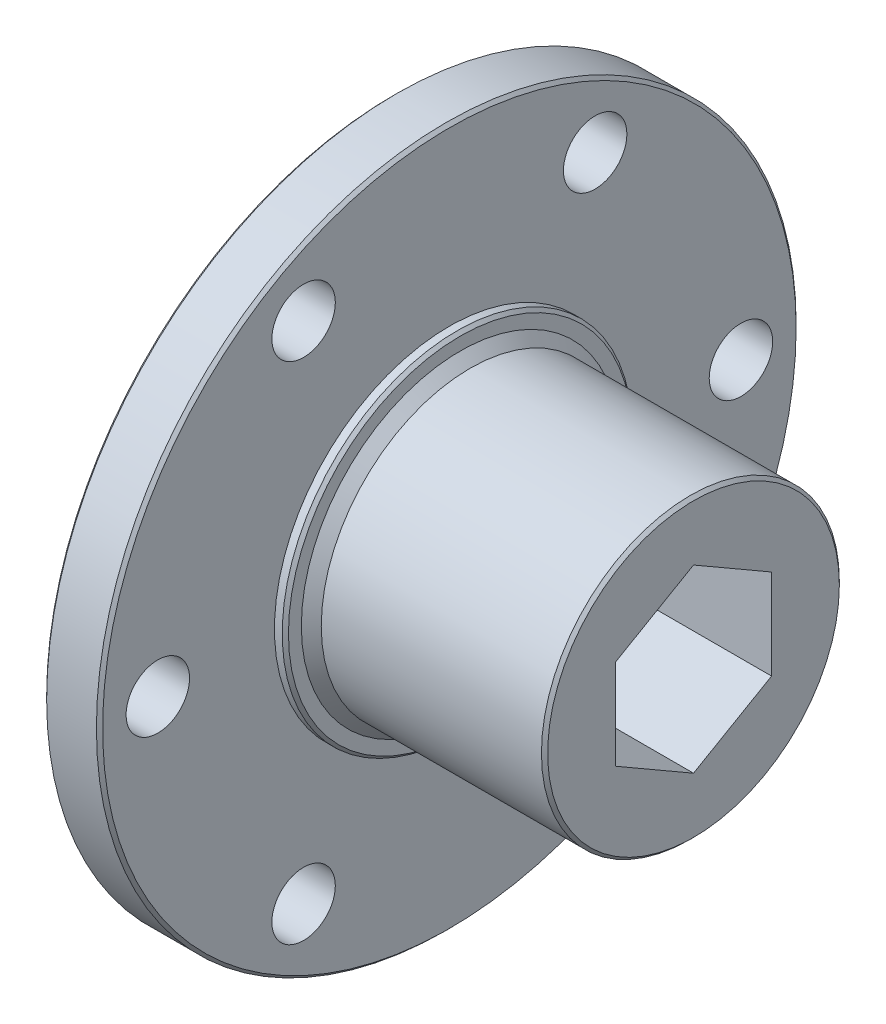
ISO-10303-21;
HEADER;
FILE_DESCRIPTION(('STEP AP214'),'2;1');
FILE_NAME('part.step','',(''),(''),'','','');
FILE_SCHEMA(('AUTOMOTIVE_DESIGN { 1 0 10303 214 1 1 1 1 }'));
ENDSEC;
DATA;
#1=APPLICATION_CONTEXT('core data for automotive mechanical design processes');
#2=APPLICATION_PROTOCOL_DEFINITION('international standard','automotive_design',2000,#1);
#3=PRODUCT_CONTEXT('',#1,'mechanical');
#4=PRODUCT('Part','Part','',(#3));
#5=PRODUCT_RELATED_PRODUCT_CATEGORY('part','',(#4));
#6=PRODUCT_DEFINITION_FORMATION('','',#4);
#7=PRODUCT_DEFINITION_CONTEXT('part definition',#1,'design');
#8=PRODUCT_DEFINITION('design','',#6,#7);
#9=PRODUCT_DEFINITION_SHAPE('','',#8);
#10=(LENGTH_UNIT() NAMED_UNIT(*) SI_UNIT(.MILLI.,.METRE.));
#11=(NAMED_UNIT(*) PLANE_ANGLE_UNIT() SI_UNIT($,.RADIAN.));
#12=(NAMED_UNIT(*) SI_UNIT($,.STERADIAN.) SOLID_ANGLE_UNIT());
#13=UNCERTAINTY_MEASURE_WITH_UNIT(LENGTH_MEASURE(1.E-05),#10,'distance_accuracy_value','');
#14=(GEOMETRIC_REPRESENTATION_CONTEXT(3) GLOBAL_UNCERTAINTY_ASSIGNED_CONTEXT((#13)) GLOBAL_UNIT_ASSIGNED_CONTEXT((#10,
#11,#12)) REPRESENTATION_CONTEXT('',''));
#15=CARTESIAN_POINT('',(0.,0.,0.));
#16=DIRECTION('',(0.,0.,1.));
#17=DIRECTION('',(1.,0.,0.));
#18=AXIS2_PLACEMENT_3D('',#15,#16,#17);
#19=CARTESIAN_POINT('',(-13.9240662460568,0.,0.));
#20=DIRECTION('',(-1.,0.,0.));
#21=DIRECTION('',(0.,0.,1.));
#22=AXIS2_PLACEMENT_3D('',#19,#20,#21);
#23=CYLINDRICAL_SURFACE('',#22,28.575);
#24=CARTESIAN_POINT('',(-18.2420662460566,0.,0.));
#25=DIRECTION('',(-1.,0.,0.));
#26=DIRECTION('',(0.,0.,1.));
#27=AXIS2_PLACEMENT_3D('',#24,#25,#26);
#28=CIRCLE('',#27,28.575);
#29=CARTESIAN_POINT('',(-18.2420662460566,0.,28.575));
#30=VERTEX_POINT('',#29);
#31=EDGE_CURVE('E179',#30,#30,#28,.F.);
#32=ORIENTED_EDGE('',*,*,#31,.T.);
#33=EDGE_LOOP('',(#32));
#34=FACE_BOUND('',#33,.T.);
#35=CARTESIAN_POINT('',(-14.1780662460569,0.,0.));
#36=DIRECTION('',(1.,0.,0.));
#37=DIRECTION('',(0.,0.,-1.));
#38=AXIS2_PLACEMENT_3D('',#35,#36,#37);
#39=CIRCLE('',#38,28.575);
#40=CARTESIAN_POINT('',(-14.1780662460569,0.,-28.575));
#41=VERTEX_POINT('',#40);
#42=EDGE_CURVE('E176',#41,#41,#39,.F.);
#43=ORIENTED_EDGE('',*,*,#42,.T.);
#44=EDGE_LOOP('',(#43));
#45=FACE_BOUND('',#44,.T.);
#46=ADVANCED_FACE('F37',(#34,#45),#23,.T.);
#47=CARTESIAN_POINT('',(-13.9240662460568,28.575,0.));
#48=DIRECTION('',(1.,0.,0.));
#49=DIRECTION('',(0.,0.,-1.));
#50=AXIS2_PLACEMENT_3D('',#47,#48,#49);
#51=PLANE('',#50);
#52=CARTESIAN_POINT('',(-13.9240662460568,0.,0.));
#53=DIRECTION('',(1.,0.,0.));
#54=DIRECTION('',(0.,0.,-1.));
#55=AXIS2_PLACEMENT_3D('',#52,#53,#54);
#56=CIRCLE('',#55,28.3209999999999);
#57=CARTESIAN_POINT('',(-13.9240662460568,0.,-28.3209999999999));
#58=VERTEX_POINT('',#57);
#59=EDGE_CURVE('E11',#58,#58,#56,.T.);
#60=ORIENTED_EDGE('',*,*,#59,.T.);
#61=EDGE_LOOP('',(#60));
#62=FACE_BOUND('',#61,.T.);
#63=CARTESIAN_POINT('',(-13.9240662460568,20.6222299276169,11.90625));
#64=DIRECTION('',(1.,0.,0.));
#65=DIRECTION('',(0.,0.,-1.));
#66=AXIS2_PLACEMENT_3D('',#63,#64,#65);
#67=CIRCLE('',#66,2.5908);
#68=CARTESIAN_POINT('',(-13.9240662460568,20.6222299276169,9.31545000000001));
#69=VERTEX_POINT('',#68);
#70=EDGE_CURVE('E157',#69,#69,#67,.T.);
#71=ORIENTED_EDGE('',*,*,#70,.F.);
#72=EDGE_LOOP('',(#71));
#73=FACE_BOUND('',#72,.T.);
#74=CARTESIAN_POINT('',(-13.9240662460568,0.,-23.8125));
#75=DIRECTION('',(1.,0.,0.));
#76=DIRECTION('',(0.,0.,-1.));
#77=AXIS2_PLACEMENT_3D('',#74,#75,#76);
#78=CIRCLE('',#77,2.5908);
#79=CARTESIAN_POINT('',(-13.9240662460568,0.,-26.4033));
#80=VERTEX_POINT('',#79);
#81=EDGE_CURVE('E331',#80,#80,#78,.T.);
#82=ORIENTED_EDGE('',*,*,#81,.F.);
#83=EDGE_LOOP('',(#82));
#84=FACE_BOUND('',#83,.T.);
#85=CARTESIAN_POINT('',(-13.9240662460568,-20.622229927617,11.9062499999999));
#86=DIRECTION('',(1.,0.,0.));
#87=DIRECTION('',(0.,0.,-1.));
#88=AXIS2_PLACEMENT_3D('',#85,#86,#87);
#89=CIRCLE('',#88,2.5908);
#90=CARTESIAN_POINT('',(-13.9240662460568,-20.622229927617,9.31544999999995));
#91=VERTEX_POINT('',#90);
#92=EDGE_CURVE('E335',#91,#91,#89,.T.);
#93=ORIENTED_EDGE('',*,*,#92,.F.);
#94=EDGE_LOOP('',(#93));
#95=FACE_BOUND('',#94,.T.);
#96=CARTESIAN_POINT('',(-13.9240662460568,-20.6222299276169,-11.90625));
#97=DIRECTION('',(1.,0.,0.));
#98=DIRECTION('',(0.,0.,-1.));
#99=AXIS2_PLACEMENT_3D('',#96,#97,#98);
#100=CIRCLE('',#99,2.5908);
#101=CARTESIAN_POINT('',(-13.9240662460568,-20.6222299276169,-14.49705));
#102=VERTEX_POINT('',#101);
#103=EDGE_CURVE('E339',#102,#102,#100,.T.);
#104=ORIENTED_EDGE('',*,*,#103,.F.);
#105=EDGE_LOOP('',(#104));
#106=FACE_BOUND('',#105,.T.);
#107=CARTESIAN_POINT('',(-13.9240662460568,20.622229927617,-11.90625));
#108=DIRECTION('',(1.,0.,0.));
#109=DIRECTION('',(0.,0.,-1.));
#110=AXIS2_PLACEMENT_3D('',#107,#108,#109);
#111=CIRCLE('',#110,2.5908);
#112=CARTESIAN_POINT('',(-13.9240662460568,20.622229927617,-14.49705));
#113=VERTEX_POINT('',#112);
#114=EDGE_CURVE('E343',#113,#113,#111,.T.);
#115=ORIENTED_EDGE('',*,*,#114,.F.);
#116=EDGE_LOOP('',(#115));
#117=FACE_BOUND('',#116,.T.);
#118=CARTESIAN_POINT('',(-13.9240662460568,0.,23.8125));
#119=DIRECTION('',(1.,0.,0.));
#120=DIRECTION('',(0.,0.,-1.));
#121=AXIS2_PLACEMENT_3D('',#118,#119,#120);
#122=CIRCLE('',#121,2.5908);
#123=CARTESIAN_POINT('',(-13.9240662460568,0.,21.2217));
#124=VERTEX_POINT('',#123);
#125=EDGE_CURVE('E114',#124,#124,#122,.T.);
#126=ORIENTED_EDGE('',*,*,#125,.F.);
#127=EDGE_LOOP('',(#126));
#128=FACE_BOUND('',#127,.T.);
#129=CARTESIAN_POINT('',(-13.9240662460568,0.,0.));
#130=DIRECTION('',(1.,0.,0.));
#131=DIRECTION('',(0.,0.,-1.));
#132=AXIS2_PLACEMENT_3D('',#129,#130,#131);
#133=CIRCLE('',#132,14.2875);
#134=CARTESIAN_POINT('',(-13.9240662460568,0.,-14.2875));
#135=VERTEX_POINT('',#134);
#136=EDGE_CURVE('E152',#135,#135,#133,.T.);
#137=ORIENTED_EDGE('',*,*,#136,.F.);
#138=EDGE_LOOP('',(#137));
#139=FACE_BOUND('',#138,.T.);
#140=ADVANCED_FACE('F214',(#62,#73,#84,#95,#106,#117,#128,#139),#51,.T.);
#141=CARTESIAN_POINT('',(-18.4960662460568,0.,0.));
#142=DIRECTION('',(-1.,0.,0.));
#143=DIRECTION('',(0.,0.,1.));
#144=AXIS2_PLACEMENT_3D('',#141,#142,#143);
#145=PLANE('',#144);
#146=CARTESIAN_POINT('',(-18.4960662460568,0.,0.));
#147=DIRECTION('',(-1.,0.,0.));
#148=DIRECTION('',(0.,0.,1.));
#149=AXIS2_PLACEMENT_3D('',#146,#147,#148);
#150=CIRCLE('',#149,28.3209999999999);
#151=CARTESIAN_POINT('',(-18.4960662460568,0.,28.3209999999999));
#152=VERTEX_POINT('',#151);
#153=EDGE_CURVE('E173',#152,#152,#150,.T.);
#154=ORIENTED_EDGE('',*,*,#153,.T.);
#155=EDGE_LOOP('',(#154));
#156=FACE_BOUND('',#155,.T.);
#157=CARTESIAN_POINT('',(-18.4960662460568,20.6222299276169,11.90625));
#158=DIRECTION('',(-1.,0.,0.));
#159=DIRECTION('',(0.,0.,1.));
#160=AXIS2_PLACEMENT_3D('',#157,#158,#159);
#161=CIRCLE('',#160,2.5908);
#162=CARTESIAN_POINT('',(-18.4960662460568,20.6222299276169,14.49705));
#163=VERTEX_POINT('',#162);
#164=EDGE_CURVE('E161',#163,#163,#161,.T.);
#165=ORIENTED_EDGE('',*,*,#164,.F.);
#166=EDGE_LOOP('',(#165));
#167=FACE_BOUND('',#166,.T.);
#168=CARTESIAN_POINT('',(-18.4960662460568,0.,-23.8125));
#169=DIRECTION('',(-1.,0.,0.));
#170=DIRECTION('',(0.,0.,1.));
#171=AXIS2_PLACEMENT_3D('',#168,#169,#170);
#172=CIRCLE('',#171,2.5908);
#173=CARTESIAN_POINT('',(-18.4960662460568,0.,-21.2217));
#174=VERTEX_POINT('',#173);
#175=EDGE_CURVE('E160',#174,#174,#172,.T.);
#176=ORIENTED_EDGE('',*,*,#175,.F.);
#177=EDGE_LOOP('',(#176));
#178=FACE_BOUND('',#177,.T.);
#179=CARTESIAN_POINT('',(-18.4960662460568,-20.622229927617,11.9062499999999));
#180=DIRECTION('',(-1.,0.,0.));
#181=DIRECTION('',(0.,0.,1.));
#182=AXIS2_PLACEMENT_3D('',#179,#180,#181);
#183=CIRCLE('',#182,2.5908);
#184=CARTESIAN_POINT('',(-18.4960662460568,-20.622229927617,14.4970499999999));
#185=VERTEX_POINT('',#184);
#186=EDGE_CURVE('E254',#185,#185,#183,.T.);
#187=ORIENTED_EDGE('',*,*,#186,.F.);
#188=EDGE_LOOP('',(#187));
#189=FACE_BOUND('',#188,.T.);
#190=CARTESIAN_POINT('',(-18.4960662460568,-20.6222299276169,-11.90625));
#191=DIRECTION('',(-1.,0.,0.));
#192=DIRECTION('',(0.,0.,1.));
#193=AXIS2_PLACEMENT_3D('',#190,#191,#192);
#194=CIRCLE('',#193,2.5908);
#195=CARTESIAN_POINT('',(-18.4960662460568,-20.6222299276169,-9.31545000000004));
#196=VERTEX_POINT('',#195);
#197=EDGE_CURVE('E258',#196,#196,#194,.T.);
#198=ORIENTED_EDGE('',*,*,#197,.F.);
#199=EDGE_LOOP('',(#198));
#200=FACE_BOUND('',#199,.T.);
#201=CARTESIAN_POINT('',(-18.4960662460568,20.622229927617,-11.90625));
#202=DIRECTION('',(-1.,0.,0.));
#203=DIRECTION('',(0.,0.,1.));
#204=AXIS2_PLACEMENT_3D('',#201,#202,#203);
#205=CIRCLE('',#204,2.5908);
#206=CARTESIAN_POINT('',(-18.4960662460568,20.622229927617,-9.31544999999997));
#207=VERTEX_POINT('',#206);
#208=EDGE_CURVE('E262',#207,#207,#205,.T.);
#209=ORIENTED_EDGE('',*,*,#208,.F.);
#210=EDGE_LOOP('',(#209));
#211=FACE_BOUND('',#210,.T.);
#212=CARTESIAN_POINT('',(-18.4960662460568,0.,23.8125));
#213=DIRECTION('',(-1.,0.,0.));
#214=DIRECTION('',(0.,0.,1.));
#215=AXIS2_PLACEMENT_3D('',#212,#213,#214);
#216=CIRCLE('',#215,2.5908);
#217=CARTESIAN_POINT('',(-18.4960662460568,0.,26.4033));
#218=VERTEX_POINT('',#217);
#219=EDGE_CURVE('E266',#218,#218,#216,.T.);
#220=ORIENTED_EDGE('',*,*,#219,.F.);
#221=EDGE_LOOP('',(#220));
#222=FACE_BOUND('',#221,.T.);
#223=CARTESIAN_POINT('',(-18.4960662460568,0.,0.));
#224=DIRECTION('',(-1.,0.,0.));
#225=DIRECTION('',(0.,0.,1.));
#226=AXIS2_PLACEMENT_3D('',#223,#224,#225);
#227=CIRCLE('',#226,14.2875);
#228=CARTESIAN_POINT('',(-18.4960662460568,0.,14.2875));
#229=VERTEX_POINT('',#228);
#230=EDGE_CURVE('E145',#229,#229,#227,.T.);
#231=ORIENTED_EDGE('',*,*,#230,.F.);
#232=EDGE_LOOP('',(#231));
#233=FACE_BOUND('',#232,.T.);
#234=ADVANCED_FACE('F220',(#156,#167,#178,#189,#200,#211,#222,#233),#145,.T.);
#235=CARTESIAN_POINT('',(-13.0350662460568,0.,0.));
#236=DIRECTION('',(-1.,0.,0.));
#237=DIRECTION('',(0.,0.,1.));
#238=AXIS2_PLACEMENT_3D('',#235,#236,#237);
#239=CYLINDRICAL_SURFACE('',#238,14.2875);
#240=CARTESIAN_POINT('',(-13.2890662460569,0.,0.));
#241=DIRECTION('',(1.,0.,0.));
#242=DIRECTION('',(0.,0.,-1.));
#243=AXIS2_PLACEMENT_3D('',#240,#241,#242);
#244=CIRCLE('',#243,14.2875);
#245=CARTESIAN_POINT('',(-13.2890662460569,0.,-14.2875));
#246=VERTEX_POINT('',#245);
#247=EDGE_CURVE('E45',#246,#246,#244,.F.);
#248=ORIENTED_EDGE('',*,*,#247,.T.);
#249=EDGE_LOOP('',(#248));
#250=FACE_BOUND('',#249,.T.);
#251=ORIENTED_EDGE('',*,*,#136,.T.);
#252=EDGE_LOOP('',(#251));
#253=FACE_BOUND('',#252,.T.);
#254=ADVANCED_FACE('F187',(#250,#253),#239,.T.);
#255=CARTESIAN_POINT('',(-13.0350662460568,0.,0.));
#256=DIRECTION('',(1.,0.,0.));
#257=DIRECTION('',(0.,0.,-1.));
#258=AXIS2_PLACEMENT_3D('',#255,#256,#257);
#259=PLANE('',#258);
#260=CARTESIAN_POINT('',(-13.0350662460568,0.,0.));
#261=DIRECTION('',(1.,0.,0.));
#262=DIRECTION('',(0.,0.,-1.));
#263=AXIS2_PLACEMENT_3D('',#260,#261,#262);
#264=CIRCLE('',#263,14.0334999999999);
#265=CARTESIAN_POINT('',(-13.0350662460568,0.,-14.0334999999999));
#266=VERTEX_POINT('',#265);
#267=EDGE_CURVE('E182',#266,#266,#264,.T.);
#268=ORIENTED_EDGE('',*,*,#267,.T.);
#269=EDGE_LOOP('',(#268));
#270=FACE_BOUND('',#269,.T.);
#271=CARTESIAN_POINT('',(-13.0350662460568,0.,0.));
#272=DIRECTION('',(1.,0.,0.));
#273=DIRECTION('',(0.,0.,-1.));
#274=AXIS2_PLACEMENT_3D('',#271,#272,#273);
#275=CIRCLE('',#274,12.9794);
#276=CARTESIAN_POINT('',(-13.0350662460568,0.,-12.9794));
#277=VERTEX_POINT('',#276);
#278=EDGE_CURVE('E149',#277,#277,#275,.T.);
#279=ORIENTED_EDGE('',*,*,#278,.F.);
#280=EDGE_LOOP('',(#279));
#281=FACE_BOUND('',#280,.T.);
#282=ADVANCED_FACE('F196',(#270,#281),#259,.T.);
#283=CARTESIAN_POINT('',(-13.0350662460568,0.,0.));
#284=DIRECTION('',(-1.,0.,0.));
#285=DIRECTION('',(0.,0.,-1.));
#286=AXIS2_PLACEMENT_3D('',#283,#284,#285);
#287=CONICAL_SURFACE('',#286,12.9794,0.785398163397434);
#288=CARTESIAN_POINT('',(-12.2222662460567,0.,0.));
#289=DIRECTION('',(1.,0.,0.));
#290=DIRECTION('',(0.,0.,-1.));
#291=AXIS2_PLACEMENT_3D('',#288,#289,#290);
#292=CIRCLE('',#291,12.1666);
#293=CARTESIAN_POINT('',(-12.2222662460567,0.,-12.1666));
#294=VERTEX_POINT('',#293);
#295=EDGE_CURVE('E137',#294,#294,#292,.T.);
#296=ORIENTED_EDGE('',*,*,#295,.F.);
#297=EDGE_LOOP('',(#296));
#298=FACE_BOUND('',#297,.T.);
#299=ORIENTED_EDGE('',*,*,#278,.T.);
#300=EDGE_LOOP('',(#299));
#301=FACE_BOUND('',#300,.T.);
#302=ADVANCED_FACE('F199',(#298,#301),#287,.T.);
#303=CARTESIAN_POINT('',(6.01493375394323,0.,0.));
#304=DIRECTION('',(-1.,0.,0.));
#305=DIRECTION('',(0.,0.,1.));
#306=AXIS2_PLACEMENT_3D('',#303,#304,#305);
#307=CYLINDRICAL_SURFACE('',#306,12.1666);
#308=CARTESIAN_POINT('',(5.76093375394317,0.,0.));
#309=DIRECTION('',(1.,0.,0.));
#310=DIRECTION('',(0.,0.,-1.));
#311=AXIS2_PLACEMENT_3D('',#308,#309,#310);
#312=CIRCLE('',#311,12.1666);
#313=CARTESIAN_POINT('',(5.76093375394317,0.,-12.1666));
#314=VERTEX_POINT('',#313);
#315=EDGE_CURVE('E170',#314,#314,#312,.F.);
#316=ORIENTED_EDGE('',*,*,#315,.T.);
#317=EDGE_LOOP('',(#316));
#318=FACE_BOUND('',#317,.T.);
#319=ORIENTED_EDGE('',*,*,#295,.T.);
#320=EDGE_LOOP('',(#319));
#321=FACE_BOUND('',#320,.T.);
#322=ADVANCED_FACE('F204',(#318,#321),#307,.T.);
#323=CARTESIAN_POINT('',(6.01493375394323,0.,0.));
#324=DIRECTION('',(1.,0.,0.));
#325=DIRECTION('',(0.,0.,-1.));
#326=AXIS2_PLACEMENT_3D('',#323,#324,#325);
#327=PLANE('',#326);
#328=CARTESIAN_POINT('',(6.01493375394323,0.,0.));
#329=DIRECTION('',(1.,0.,0.));
#330=DIRECTION('',(0.,0.,-1.));
#331=AXIS2_PLACEMENT_3D('',#328,#329,#330);
#332=CIRCLE('',#331,11.9125999999999);
#333=CARTESIAN_POINT('',(6.01493375394323,0.,-11.9125999999999));
#334=VERTEX_POINT('',#333);
#335=EDGE_CURVE('E167',#334,#334,#332,.T.);
#336=ORIENTED_EDGE('',*,*,#335,.T.);
#337=EDGE_LOOP('',(#336));
#338=FACE_BOUND('',#337,.T.);
#339=DIRECTION('',(0.,0.500000000000001,-0.866025403784438));
#340=VECTOR('',#339,1.);
#341=CARTESIAN_POINT('',(6.01493375394323,3.68081890619155,6.3754));
#342=LINE('',#341,#340);
#343=CARTESIAN_POINT('',(6.01493375394323,3.68081890619155,6.3754));
#344=VERTEX_POINT('',#343);
#345=CARTESIAN_POINT('',(6.01493375394323,7.3616578123831,0.));
#346=VERTEX_POINT('',#345);
#347=EDGE_CURVE('E92',#344,#346,#342,.T.);
#348=ORIENTED_EDGE('',*,*,#347,.T.);
#349=DIRECTION('',(0.,-0.500000000000001,-0.866025403784438));
#350=VECTOR('',#349,1.);
#351=CARTESIAN_POINT('',(6.01493375394323,7.3616578123831,0.));
#352=LINE('',#351,#350);
#353=CARTESIAN_POINT('',(6.01493375394323,3.68081890619154,-6.37539999999999));
#354=VERTEX_POINT('',#353);
#355=EDGE_CURVE('E101',#346,#354,#352,.T.);
#356=ORIENTED_EDGE('',*,*,#355,.T.);
#357=DIRECTION('',(0.,-1.,0.));
#358=VECTOR('',#357,1.);
#359=CARTESIAN_POINT('',(6.01493375394323,3.68081890619155,-6.37539999999999));
#360=LINE('',#359,#358);
#361=CARTESIAN_POINT('',(6.01493375394323,-3.68085890619153,-6.37539999999999));
#362=VERTEX_POINT('',#361);
#363=EDGE_CURVE('E52',#354,#362,#360,.T.);
#364=ORIENTED_EDGE('',*,*,#363,.T.);
#365=DIRECTION('',(0.,-0.500000000000001,0.866025403784438));
#366=VECTOR('',#365,1.);
#367=CARTESIAN_POINT('',(6.01493375394323,-3.68085890619153,-6.37539999999999));
#368=LINE('',#367,#366);
#369=CARTESIAN_POINT('',(6.01493375394323,-7.36169781238308,0.));
#370=VERTEX_POINT('',#369);
#371=EDGE_CURVE('E118',#362,#370,#368,.T.);
#372=ORIENTED_EDGE('',*,*,#371,.T.);
#373=DIRECTION('',(0.,0.500000000000001,0.866025403784438));
#374=VECTOR('',#373,1.);
#375=CARTESIAN_POINT('',(6.01493375394323,-7.36169781238308,0.));
#376=LINE('',#375,#374);
#377=CARTESIAN_POINT('',(6.01493375394323,-3.68085890619153,6.3754));
#378=VERTEX_POINT('',#377);
#379=EDGE_CURVE('E121',#370,#378,#376,.T.);
#380=ORIENTED_EDGE('',*,*,#379,.T.);
#381=DIRECTION('',(0.,1.,0.));
#382=VECTOR('',#381,1.);
#383=CARTESIAN_POINT('',(6.01493375394323,-3.68085890619153,6.3754));
#384=LINE('',#383,#382);
#385=EDGE_CURVE('E98',#378,#344,#384,.T.);
#386=ORIENTED_EDGE('',*,*,#385,.T.);
#387=EDGE_LOOP('',(#348,#356,#364,#372,#380,#386));
#388=FACE_BOUND('',#387,.T.);
#389=ADVANCED_FACE('F105',(#338,#388),#327,.T.);
#390=CARTESIAN_POINT('',(-19.3850662460568,0.,0.));
#391=DIRECTION('',(1.,0.,0.));
#392=DIRECTION('',(0.,0.,-1.));
#393=AXIS2_PLACEMENT_3D('',#390,#391,#392);
#394=CYLINDRICAL_SURFACE('',#393,14.2875);
#395=CARTESIAN_POINT('',(-19.1310662460567,0.,0.));
#396=DIRECTION('',(-1.,0.,0.));
#397=DIRECTION('',(0.,0.,1.));
#398=AXIS2_PLACEMENT_3D('',#395,#396,#397);
#399=CIRCLE('',#398,14.2875);
#400=CARTESIAN_POINT('',(-19.1310662460567,0.,14.2875));
#401=VERTEX_POINT('',#400);
#402=EDGE_CURVE('E164',#401,#401,#399,.F.);
#403=ORIENTED_EDGE('',*,*,#402,.T.);
#404=EDGE_LOOP('',(#403));
#405=FACE_BOUND('',#404,.T.);
#406=ORIENTED_EDGE('',*,*,#230,.T.);
#407=EDGE_LOOP('',(#406));
#408=FACE_BOUND('',#407,.T.);
#409=ADVANCED_FACE('F269',(#405,#408),#394,.T.);
#410=CARTESIAN_POINT('',(-19.3850662460568,0.,0.));
#411=DIRECTION('',(-1.,0.,0.));
#412=DIRECTION('',(0.,0.,1.));
#413=AXIS2_PLACEMENT_3D('',#410,#411,#412);
#414=PLANE('',#413);
#415=CARTESIAN_POINT('',(-19.3850662460568,0.,0.));
#416=DIRECTION('',(-1.,0.,0.));
#417=DIRECTION('',(0.,0.,1.));
#418=AXIS2_PLACEMENT_3D('',#415,#416,#417);
#419=CIRCLE('',#418,14.0334999999999);
#420=CARTESIAN_POINT('',(-19.3850662460568,0.,14.0334999999999));
#421=VERTEX_POINT('',#420);
#422=EDGE_CURVE('E148',#421,#421,#419,.T.);
#423=ORIENTED_EDGE('',*,*,#422,.T.);
#424=EDGE_LOOP('',(#423));
#425=FACE_BOUND('',#424,.T.);
#426=DIRECTION('',(0.,0.500000000000001,-0.866025403784438));
#427=VECTOR('',#426,1.);
#428=CARTESIAN_POINT('',(-19.3850662460568,3.68081890619155,6.3754));
#429=LINE('',#428,#427);
#430=CARTESIAN_POINT('',(-19.3850662460568,3.68081890619155,6.3754));
#431=VERTEX_POINT('',#430);
#432=CARTESIAN_POINT('',(-19.3850662460568,7.36165781238309,0.));
#433=VERTEX_POINT('',#432);
#434=EDGE_CURVE('E60',#431,#433,#429,.T.);
#435=ORIENTED_EDGE('',*,*,#434,.F.);
#436=DIRECTION('',(0.,1.,0.));
#437=VECTOR('',#436,1.);
#438=CARTESIAN_POINT('',(-19.3850662460568,-3.68085890619153,6.3754));
#439=LINE('',#438,#437);
#440=CARTESIAN_POINT('',(-19.3850662460568,-3.68085890619153,6.3754));
#441=VERTEX_POINT('',#440);
#442=EDGE_CURVE('E108',#441,#431,#439,.T.);
#443=ORIENTED_EDGE('',*,*,#442,.F.);
#444=DIRECTION('',(0.,0.500000000000001,0.866025403784438));
#445=VECTOR('',#444,1.);
#446=CARTESIAN_POINT('',(-19.3850662460568,-7.36169781238308,0.));
#447=LINE('',#446,#445);
#448=CARTESIAN_POINT('',(-19.3850662460568,-7.36169781238308,0.));
#449=VERTEX_POINT('',#448);
#450=EDGE_CURVE('E111',#449,#441,#447,.T.);
#451=ORIENTED_EDGE('',*,*,#450,.F.);
#452=DIRECTION('',(0.,-0.500000000000001,0.866025403784438));
#453=VECTOR('',#452,1.);
#454=CARTESIAN_POINT('',(-19.3850662460568,-3.68085890619153,-6.37539999999999));
#455=LINE('',#454,#453);
#456=CARTESIAN_POINT('',(-19.3850662460568,-3.68085890619153,-6.37539999999999));
#457=VERTEX_POINT('',#456);
#458=EDGE_CURVE('E130',#457,#449,#455,.T.);
#459=ORIENTED_EDGE('',*,*,#458,.F.);
#460=DIRECTION('',(0.,-1.,0.));
#461=VECTOR('',#460,1.);
#462=CARTESIAN_POINT('',(-19.3850662460568,3.68081890619155,-6.37539999999999));
#463=LINE('',#462,#461);
#464=CARTESIAN_POINT('',(-19.3850662460568,3.68081890619155,-6.37539999999999));
#465=VERTEX_POINT('',#464);
#466=EDGE_CURVE('E127',#465,#457,#463,.T.);
#467=ORIENTED_EDGE('',*,*,#466,.F.);
#468=DIRECTION('',(0.,-0.500000000000001,-0.866025403784438));
#469=VECTOR('',#468,1.);
#470=CARTESIAN_POINT('',(-19.3850662460568,7.3616578123831,0.));
#471=LINE('',#470,#469);
#472=EDGE_CURVE('E125',#433,#465,#471,.T.);
#473=ORIENTED_EDGE('',*,*,#472,.F.);
#474=EDGE_LOOP('',(#435,#443,#451,#459,#467,#473));
#475=FACE_BOUND('',#474,.T.);
#476=ADVANCED_FACE('F271',(#425,#475),#414,.T.);
#477=CARTESIAN_POINT('',(6.01493375394323,3.68081890619155,6.3754));
#478=DIRECTION('',(0.,0.866025403784438,0.500000000000001));
#479=DIRECTION('',(0.,-0.500000000000001,0.866025403784438));
#480=AXIS2_PLACEMENT_3D('',#477,#478,#479);
#481=PLANE('',#480);
#482=ORIENTED_EDGE('',*,*,#434,.T.);
#483=DIRECTION('',(-1.,0.,0.));
#484=VECTOR('',#483,1.);
#485=CARTESIAN_POINT('',(6.01493375394323,7.3616578123831,0.));
#486=LINE('',#485,#484);
#487=EDGE_CURVE('E88',#346,#433,#486,.T.);
#488=ORIENTED_EDGE('',*,*,#487,.F.);
#489=ORIENTED_EDGE('',*,*,#347,.F.);
#490=DIRECTION('',(-1.,0.,0.));
#491=VECTOR('',#490,1.);
#492=CARTESIAN_POINT('',(6.01493375394323,3.68081890619155,6.3754));
#493=LINE('',#492,#491);
#494=EDGE_CURVE('E135',#344,#431,#493,.T.);
#495=ORIENTED_EDGE('',*,*,#494,.T.);
#496=EDGE_LOOP('',(#482,#488,#489,#495));
#497=FACE_BOUND('',#496,.T.);
#498=ADVANCED_FACE('F90',(#497),#481,.F.);
#499=CARTESIAN_POINT('',(6.01493375394323,-3.68085890619153,6.3754));
#500=DIRECTION('',(0.,0.,1.));
#501=DIRECTION('',(0.,-1.,0.));
#502=AXIS2_PLACEMENT_3D('',#499,#500,#501);
#503=PLANE('',#502);
#504=ORIENTED_EDGE('',*,*,#442,.T.);
#505=ORIENTED_EDGE('',*,*,#494,.F.);
#506=ORIENTED_EDGE('',*,*,#385,.F.);
#507=DIRECTION('',(-1.,0.,0.));
#508=VECTOR('',#507,1.);
#509=CARTESIAN_POINT('',(6.01493375394323,-3.68085890619153,6.3754));
#510=LINE('',#509,#508);
#511=EDGE_CURVE('E138',#378,#441,#510,.T.);
#512=ORIENTED_EDGE('',*,*,#511,.T.);
#513=EDGE_LOOP('',(#504,#505,#506,#512));
#514=FACE_BOUND('',#513,.T.);
#515=ADVANCED_FACE('F285',(#514),#503,.F.);
#516=CARTESIAN_POINT('',(6.01493375394323,-7.36169781238308,0.));
#517=DIRECTION('',(0.,-0.866025403784438,0.500000000000001));
#518=DIRECTION('',(0.,-0.500000000000001,-0.866025403784438));
#519=AXIS2_PLACEMENT_3D('',#516,#517,#518);
#520=PLANE('',#519);
#521=ORIENTED_EDGE('',*,*,#450,.T.);
#522=ORIENTED_EDGE('',*,*,#511,.F.);
#523=ORIENTED_EDGE('',*,*,#379,.F.);
#524=DIRECTION('',(-1.,0.,0.));
#525=VECTOR('',#524,1.);
#526=CARTESIAN_POINT('',(6.01493375394323,-7.36169781238308,0.));
#527=LINE('',#526,#525);
#528=EDGE_CURVE('E140',#370,#449,#527,.T.);
#529=ORIENTED_EDGE('',*,*,#528,.T.);
#530=EDGE_LOOP('',(#521,#522,#523,#529));
#531=FACE_BOUND('',#530,.T.);
#532=ADVANCED_FACE('F295',(#531),#520,.F.);
#533=CARTESIAN_POINT('',(6.01493375394323,-3.68085890619153,-6.37539999999999));
#534=DIRECTION('',(0.,-0.866025403784438,-0.500000000000001));
#535=DIRECTION('',(0.,0.500000000000001,-0.866025403784438));
#536=AXIS2_PLACEMENT_3D('',#533,#534,#535);
#537=PLANE('',#536);
#538=ORIENTED_EDGE('',*,*,#458,.T.);
#539=ORIENTED_EDGE('',*,*,#528,.F.);
#540=ORIENTED_EDGE('',*,*,#371,.F.);
#541=DIRECTION('',(-1.,0.,0.));
#542=VECTOR('',#541,1.);
#543=CARTESIAN_POINT('',(6.01493375394323,-3.68085890619153,-6.37539999999999));
#544=LINE('',#543,#542);
#545=EDGE_CURVE('E142',#362,#457,#544,.T.);
#546=ORIENTED_EDGE('',*,*,#545,.T.);
#547=EDGE_LOOP('',(#538,#539,#540,#546));
#548=FACE_BOUND('',#547,.T.);
#549=ADVANCED_FACE('F292',(#548),#537,.F.);
#550=CARTESIAN_POINT('',(6.01493375394323,3.68081890619155,-6.37539999999999));
#551=DIRECTION('',(0.,0.,-1.));
#552=DIRECTION('',(0.,1.,0.));
#553=AXIS2_PLACEMENT_3D('',#550,#551,#552);
#554=PLANE('',#553);
#555=ORIENTED_EDGE('',*,*,#466,.T.);
#556=ORIENTED_EDGE('',*,*,#545,.F.);
#557=ORIENTED_EDGE('',*,*,#363,.F.);
#558=DIRECTION('',(-1.,0.,0.));
#559=VECTOR('',#558,1.);
#560=CARTESIAN_POINT('',(6.01493375394323,3.68081890619155,-6.37539999999999));
#561=LINE('',#560,#559);
#562=EDGE_CURVE('E97',#354,#465,#561,.T.);
#563=ORIENTED_EDGE('',*,*,#562,.T.);
#564=EDGE_LOOP('',(#555,#556,#557,#563));
#565=FACE_BOUND('',#564,.T.);
#566=ADVANCED_FACE('F289',(#565),#554,.F.);
#567=CARTESIAN_POINT('',(6.01493375394323,7.3616578123831,0.));
#568=DIRECTION('',(0.,0.866025403784438,-0.500000000000001));
#569=DIRECTION('',(0.,0.500000000000001,0.866025403784438));
#570=AXIS2_PLACEMENT_3D('',#567,#568,#569);
#571=PLANE('',#570);
#572=ORIENTED_EDGE('',*,*,#472,.T.);
#573=ORIENTED_EDGE('',*,*,#562,.F.);
#574=ORIENTED_EDGE('',*,*,#355,.F.);
#575=ORIENTED_EDGE('',*,*,#487,.T.);
#576=EDGE_LOOP('',(#572,#573,#574,#575));
#577=FACE_BOUND('',#576,.T.);
#578=ADVANCED_FACE('F102',(#577),#571,.F.);
#579=CARTESIAN_POINT('',(-18.4960662460568,0.,23.8125));
#580=DIRECTION('',(-1.,0.,0.));
#581=DIRECTION('',(0.,0.,1.));
#582=AXIS2_PLACEMENT_3D('',#579,#580,#581);
#583=CYLINDRICAL_SURFACE('',#582,2.5908);
#584=ORIENTED_EDGE('',*,*,#125,.T.);
#585=EDGE_LOOP('',(#584));
#586=FACE_BOUND('',#585,.T.);
#587=ORIENTED_EDGE('',*,*,#219,.T.);
#588=EDGE_LOOP('',(#587));
#589=FACE_BOUND('',#588,.T.);
#590=ADVANCED_FACE('F288',(#586,#589),#583,.F.);
#591=CARTESIAN_POINT('',(-18.4960662460568,20.622229927617,-11.90625));
#592=DIRECTION('',(-1.,0.,0.));
#593=DIRECTION('',(0.,0.,1.));
#594=AXIS2_PLACEMENT_3D('',#591,#592,#593);
#595=CYLINDRICAL_SURFACE('',#594,2.5908);
#596=ORIENTED_EDGE('',*,*,#114,.T.);
#597=EDGE_LOOP('',(#596));
#598=FACE_BOUND('',#597,.T.);
#599=ORIENTED_EDGE('',*,*,#208,.T.);
#600=EDGE_LOOP('',(#599));
#601=FACE_BOUND('',#600,.T.);
#602=ADVANCED_FACE('F305',(#598,#601),#595,.F.);
#603=CARTESIAN_POINT('',(-18.4960662460568,-20.6222299276169,-11.90625));
#604=DIRECTION('',(-1.,0.,0.));
#605=DIRECTION('',(0.,0.,1.));
#606=AXIS2_PLACEMENT_3D('',#603,#604,#605);
#607=CYLINDRICAL_SURFACE('',#606,2.5908);
#608=ORIENTED_EDGE('',*,*,#103,.T.);
#609=EDGE_LOOP('',(#608));
#610=FACE_BOUND('',#609,.T.);
#611=ORIENTED_EDGE('',*,*,#197,.T.);
#612=EDGE_LOOP('',(#611));
#613=FACE_BOUND('',#612,.T.);
#614=ADVANCED_FACE('F309',(#610,#613),#607,.F.);
#615=CARTESIAN_POINT('',(-18.4960662460568,-20.622229927617,11.9062499999999));
#616=DIRECTION('',(-1.,0.,0.));
#617=DIRECTION('',(0.,0.,1.));
#618=AXIS2_PLACEMENT_3D('',#615,#616,#617);
#619=CYLINDRICAL_SURFACE('',#618,2.5908);
#620=ORIENTED_EDGE('',*,*,#92,.T.);
#621=EDGE_LOOP('',(#620));
#622=FACE_BOUND('',#621,.T.);
#623=ORIENTED_EDGE('',*,*,#186,.T.);
#624=EDGE_LOOP('',(#623));
#625=FACE_BOUND('',#624,.T.);
#626=ADVANCED_FACE('F313',(#622,#625),#619,.F.);
#627=CARTESIAN_POINT('',(-18.4960662460568,0.,-23.8125));
#628=DIRECTION('',(-1.,0.,0.));
#629=DIRECTION('',(0.,0.,1.));
#630=AXIS2_PLACEMENT_3D('',#627,#628,#629);
#631=CYLINDRICAL_SURFACE('',#630,2.5908);
#632=ORIENTED_EDGE('',*,*,#81,.T.);
#633=EDGE_LOOP('',(#632));
#634=FACE_BOUND('',#633,.T.);
#635=ORIENTED_EDGE('',*,*,#175,.T.);
#636=EDGE_LOOP('',(#635));
#637=FACE_BOUND('',#636,.T.);
#638=ADVANCED_FACE('F317',(#634,#637),#631,.F.);
#639=CARTESIAN_POINT('',(-18.4960662460568,20.6222299276169,11.90625));
#640=DIRECTION('',(-1.,0.,0.));
#641=DIRECTION('',(0.,0.,1.));
#642=AXIS2_PLACEMENT_3D('',#639,#640,#641);
#643=CYLINDRICAL_SURFACE('',#642,2.5908);
#644=ORIENTED_EDGE('',*,*,#70,.T.);
#645=EDGE_LOOP('',(#644));
#646=FACE_BOUND('',#645,.T.);
#647=ORIENTED_EDGE('',*,*,#164,.T.);
#648=EDGE_LOOP('',(#647));
#649=FACE_BOUND('',#648,.T.);
#650=ADVANCED_FACE('F230',(#646,#649),#643,.F.);
#651=CARTESIAN_POINT('',(-19.3850662460568,0.,0.));
#652=DIRECTION('',(1.,0.,0.));
#653=DIRECTION('',(0.,0.,-1.));
#654=AXIS2_PLACEMENT_3D('',#651,#652,#653);
#655=CONICAL_SURFACE('',#654,14.0334999999999,0.785398163397448);
#656=ORIENTED_EDGE('',*,*,#402,.F.);
#657=EDGE_LOOP('',(#656));
#658=FACE_BOUND('',#657,.T.);
#659=ORIENTED_EDGE('',*,*,#422,.F.);
#660=EDGE_LOOP('',(#659));
#661=FACE_BOUND('',#660,.T.);
#662=ADVANCED_FACE('F226',(#658,#661),#655,.T.);
#663=CARTESIAN_POINT('',(6.01493375394323,0.,0.));
#664=DIRECTION('',(-1.,0.,0.));
#665=DIRECTION('',(0.,0.,1.));
#666=AXIS2_PLACEMENT_3D('',#663,#664,#665);
#667=CONICAL_SURFACE('',#666,11.9125999999999,0.785398163397452);
#668=ORIENTED_EDGE('',*,*,#315,.F.);
#669=EDGE_LOOP('',(#668));
#670=FACE_BOUND('',#669,.T.);
#671=ORIENTED_EDGE('',*,*,#335,.F.);
#672=EDGE_LOOP('',(#671));
#673=FACE_BOUND('',#672,.T.);
#674=ADVANCED_FACE('F229',(#670,#673),#667,.T.);
#675=CARTESIAN_POINT('',(-18.4960662460568,0.,0.));
#676=DIRECTION('',(1.,0.,0.));
#677=DIRECTION('',(0.,0.,-1.));
#678=AXIS2_PLACEMENT_3D('',#675,#676,#677);
#679=CONICAL_SURFACE('',#678,28.3209999999999,0.785398163397455);
#680=ORIENTED_EDGE('',*,*,#31,.F.);
#681=EDGE_LOOP('',(#680));
#682=FACE_BOUND('',#681,.T.);
#683=ORIENTED_EDGE('',*,*,#153,.F.);
#684=EDGE_LOOP('',(#683));
#685=FACE_BOUND('',#684,.T.);
#686=ADVANCED_FACE('F193',(#682,#685),#679,.T.);
#687=CARTESIAN_POINT('',(-13.0350662460568,0.,0.));
#688=DIRECTION('',(-1.,0.,0.));
#689=DIRECTION('',(0.,0.,1.));
#690=AXIS2_PLACEMENT_3D('',#687,#688,#689);
#691=CONICAL_SURFACE('',#690,14.0334999999999,0.785398163397445);
#692=ORIENTED_EDGE('',*,*,#247,.F.);
#693=EDGE_LOOP('',(#692));
#694=FACE_BOUND('',#693,.T.);
#695=ORIENTED_EDGE('',*,*,#267,.F.);
#696=EDGE_LOOP('',(#695));
#697=FACE_BOUND('',#696,.T.);
#698=ADVANCED_FACE('F190',(#694,#697),#691,.T.);
#699=CARTESIAN_POINT('',(-14.1780662460569,0.,0.));
#700=DIRECTION('',(-1.,0.,0.));
#701=DIRECTION('',(0.,0.,1.));
#702=AXIS2_PLACEMENT_3D('',#699,#700,#701);
#703=CONICAL_SURFACE('',#702,28.575,0.785398163397455);
#704=ORIENTED_EDGE('',*,*,#59,.F.);
#705=EDGE_LOOP('',(#704));
#706=FACE_BOUND('',#705,.T.);
#707=ORIENTED_EDGE('',*,*,#42,.F.);
#708=EDGE_LOOP('',(#707));
#709=FACE_BOUND('',#708,.T.);
#710=ADVANCED_FACE('F39',(#706,#709),#703,.T.);
#711=CLOSED_SHELL('',(#46,#140,#234,#254,#282,#302,#322,#389,#409,#476,#498,#515,#532,#549,#566,
#578,#590,#602,#614,#626,#638,#650,#662,#674,#686,#698,#710));
#712=MANIFOLD_SOLID_BREP('B2',#711);
#713=ADVANCED_BREP_SHAPE_REPRESENTATION('',(#18,#712),#14);
#714=SHAPE_DEFINITION_REPRESENTATION(#9,#713);
ENDSEC;
END-ISO-10303-21;
